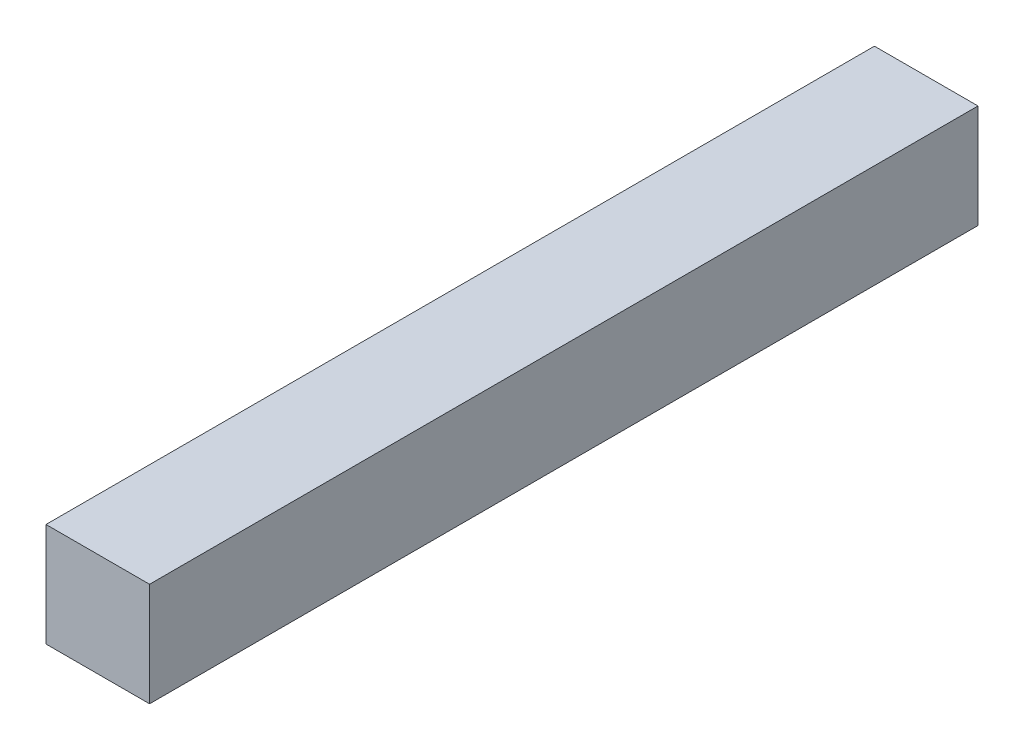
ISO-10303-21;
HEADER;
FILE_DESCRIPTION(('STEP AP214'),'2;1');
FILE_NAME('part.step','',(''),(''),'','','');
FILE_SCHEMA(('AUTOMOTIVE_DESIGN { 1 0 10303 214 1 1 1 1 }'));
ENDSEC;
DATA;
#1=APPLICATION_CONTEXT('core data for automotive mechanical design processes');
#2=APPLICATION_PROTOCOL_DEFINITION('international standard','automotive_design',2000,#1);
#3=PRODUCT_CONTEXT('',#1,'mechanical');
#4=PRODUCT('Part','Part','',(#3));
#5=PRODUCT_RELATED_PRODUCT_CATEGORY('part','',(#4));
#6=PRODUCT_DEFINITION_FORMATION('','',#4);
#7=PRODUCT_DEFINITION_CONTEXT('part definition',#1,'design');
#8=PRODUCT_DEFINITION('design','',#6,#7);
#9=PRODUCT_DEFINITION_SHAPE('','',#8);
#10=(LENGTH_UNIT() NAMED_UNIT(*) SI_UNIT(.MILLI.,.METRE.));
#11=(NAMED_UNIT(*) PLANE_ANGLE_UNIT() SI_UNIT($,.RADIAN.));
#12=(NAMED_UNIT(*) SI_UNIT($,.STERADIAN.) SOLID_ANGLE_UNIT());
#13=UNCERTAINTY_MEASURE_WITH_UNIT(LENGTH_MEASURE(1.E-05),#10,'distance_accuracy_value','');
#14=(GEOMETRIC_REPRESENTATION_CONTEXT(3) GLOBAL_UNCERTAINTY_ASSIGNED_CONTEXT((#13)) GLOBAL_UNIT_ASSIGNED_CONTEXT((#10,
#11,#12)) REPRESENTATION_CONTEXT('',''));
#15=CARTESIAN_POINT('',(0.,0.,0.));
#16=DIRECTION('',(0.,0.,1.));
#17=DIRECTION('',(1.,0.,0.));
#18=AXIS2_PLACEMENT_3D('',#15,#16,#17);
#19=CARTESIAN_POINT('',(19.05,19.05,-304.8));
#20=DIRECTION('',(1.,0.,0.));
#21=DIRECTION('',(0.,1.,0.));
#22=AXIS2_PLACEMENT_3D('',#19,#20,#21);
#23=PLANE('',#22);
#24=DIRECTION('',(0.,1.,0.));
#25=VECTOR('',#24,1.);
#26=CARTESIAN_POINT('',(19.05,19.05,0.));
#27=LINE('',#26,#25);
#28=CARTESIAN_POINT('',(19.05,-19.05,0.));
#29=VERTEX_POINT('',#28);
#30=CARTESIAN_POINT('',(19.05,19.05,0.));
#31=VERTEX_POINT('',#30);
#32=EDGE_CURVE('E109',#29,#31,#27,.T.);
#33=ORIENTED_EDGE('',*,*,#32,.F.);
#34=DIRECTION('',(0.,0.,1.));
#35=VECTOR('',#34,1.);
#36=CARTESIAN_POINT('',(19.05,-19.05,-304.8));
#37=LINE('',#36,#35);
#38=CARTESIAN_POINT('',(19.05,-19.05,-304.8));
#39=VERTEX_POINT('',#38);
#40=EDGE_CURVE('E11',#39,#29,#37,.T.);
#41=ORIENTED_EDGE('',*,*,#40,.F.);
#42=DIRECTION('',(0.,1.,0.));
#43=VECTOR('',#42,1.);
#44=CARTESIAN_POINT('',(19.05,19.05,-304.8));
#45=LINE('',#44,#43);
#46=CARTESIAN_POINT('',(19.05,19.05,-304.8));
#47=VERTEX_POINT('',#46);
#48=EDGE_CURVE('E101',#39,#47,#45,.T.);
#49=ORIENTED_EDGE('',*,*,#48,.T.);
#50=DIRECTION('',(0.,0.,1.));
#51=VECTOR('',#50,1.);
#52=CARTESIAN_POINT('',(19.05,19.05,-304.8));
#53=LINE('',#52,#51);
#54=EDGE_CURVE('E42',#47,#31,#53,.T.);
#55=ORIENTED_EDGE('',*,*,#54,.T.);
#56=EDGE_LOOP('',(#33,#41,#49,#55));
#57=FACE_BOUND('',#56,.T.);
#58=ADVANCED_FACE('F39',(#57),#23,.T.);
#59=CARTESIAN_POINT('',(-19.05,-19.05,-304.8));
#60=DIRECTION('',(0.,-1.,0.));
#61=DIRECTION('',(0.,0.,-1.));
#62=AXIS2_PLACEMENT_3D('',#59,#60,#61);
#63=PLANE('',#62);
#64=DIRECTION('',(1.,0.,0.));
#65=VECTOR('',#64,1.);
#66=CARTESIAN_POINT('',(-19.05,-19.05,0.));
#67=LINE('',#66,#65);
#68=CARTESIAN_POINT('',(-19.05,-19.05,0.));
#69=VERTEX_POINT('',#68);
#70=EDGE_CURVE('E104',#69,#29,#67,.T.);
#71=ORIENTED_EDGE('',*,*,#70,.F.);
#72=DIRECTION('',(0.,0.,1.));
#73=VECTOR('',#72,1.);
#74=CARTESIAN_POINT('',(-19.05,-19.05,-304.8));
#75=LINE('',#74,#73);
#76=CARTESIAN_POINT('',(-19.05,-19.05,-304.8));
#77=VERTEX_POINT('',#76);
#78=EDGE_CURVE('E49',#77,#69,#75,.T.);
#79=ORIENTED_EDGE('',*,*,#78,.F.);
#80=DIRECTION('',(1.,0.,0.));
#81=VECTOR('',#80,1.);
#82=CARTESIAN_POINT('',(-19.05,-19.05,-304.8));
#83=LINE('',#82,#81);
#84=EDGE_CURVE('E96',#77,#39,#83,.T.);
#85=ORIENTED_EDGE('',*,*,#84,.T.);
#86=ORIENTED_EDGE('',*,*,#40,.T.);
#87=EDGE_LOOP('',(#71,#79,#85,#86));
#88=FACE_BOUND('',#87,.T.);
#89=ADVANCED_FACE('F125',(#88),#63,.T.);
#90=CARTESIAN_POINT('',(-19.05,19.05,-304.8));
#91=DIRECTION('',(-1.,0.,0.));
#92=DIRECTION('',(0.,-1.,0.));
#93=AXIS2_PLACEMENT_3D('',#90,#91,#92);
#94=PLANE('',#93);
#95=DIRECTION('',(0.,-1.,0.));
#96=VECTOR('',#95,1.);
#97=CARTESIAN_POINT('',(-19.05,19.05,0.));
#98=LINE('',#97,#96);
#99=CARTESIAN_POINT('',(-19.05,19.05,0.));
#100=VERTEX_POINT('',#99);
#101=EDGE_CURVE('E90',#100,#69,#98,.T.);
#102=ORIENTED_EDGE('',*,*,#101,.F.);
#103=DIRECTION('',(0.,0.,1.));
#104=VECTOR('',#103,1.);
#105=CARTESIAN_POINT('',(-19.05,19.05,-304.8));
#106=LINE('',#105,#104);
#107=CARTESIAN_POINT('',(-19.05,19.05,-304.8));
#108=VERTEX_POINT('',#107);
#109=EDGE_CURVE('E85',#108,#100,#106,.T.);
#110=ORIENTED_EDGE('',*,*,#109,.F.);
#111=DIRECTION('',(0.,-1.,0.));
#112=VECTOR('',#111,1.);
#113=CARTESIAN_POINT('',(-19.05,19.05,-304.8));
#114=LINE('',#113,#112);
#115=EDGE_CURVE('E88',#108,#77,#114,.T.);
#116=ORIENTED_EDGE('',*,*,#115,.T.);
#117=ORIENTED_EDGE('',*,*,#78,.T.);
#118=EDGE_LOOP('',(#102,#110,#116,#117));
#119=FACE_BOUND('',#118,.T.);
#120=ADVANCED_FACE('F87',(#119),#94,.T.);
#121=CARTESIAN_POINT('',(-19.05,19.05,-304.8));
#122=DIRECTION('',(0.,1.,0.));
#123=DIRECTION('',(0.,0.,1.));
#124=AXIS2_PLACEMENT_3D('',#121,#122,#123);
#125=PLANE('',#124);
#126=DIRECTION('',(-1.,0.,0.));
#127=VECTOR('',#126,1.);
#128=CARTESIAN_POINT('',(-19.05,19.05,0.));
#129=LINE('',#128,#127);
#130=EDGE_CURVE('E113',#31,#100,#129,.T.);
#131=ORIENTED_EDGE('',*,*,#130,.F.);
#132=ORIENTED_EDGE('',*,*,#54,.F.);
#133=DIRECTION('',(-1.,0.,0.));
#134=VECTOR('',#133,1.);
#135=CARTESIAN_POINT('',(-19.05,19.05,-304.8));
#136=LINE('',#135,#134);
#137=EDGE_CURVE('E95',#47,#108,#136,.T.);
#138=ORIENTED_EDGE('',*,*,#137,.T.);
#139=ORIENTED_EDGE('',*,*,#109,.T.);
#140=EDGE_LOOP('',(#131,#132,#138,#139));
#141=FACE_BOUND('',#140,.T.);
#142=ADVANCED_FACE('F99',(#141),#125,.T.);
#143=CARTESIAN_POINT('',(0.,0.,-304.8));
#144=DIRECTION('',(0.,0.,1.));
#145=DIRECTION('',(1.,0.,0.));
#146=AXIS2_PLACEMENT_3D('',#143,#144,#145);
#147=PLANE('',#146);
#148=ORIENTED_EDGE('',*,*,#48,.F.);
#149=ORIENTED_EDGE('',*,*,#84,.F.);
#150=ORIENTED_EDGE('',*,*,#115,.F.);
#151=ORIENTED_EDGE('',*,*,#137,.F.);
#152=EDGE_LOOP('',(#148,#149,#150,#151));
#153=FACE_BOUND('',#152,.T.);
#154=ADVANCED_FACE('F94',(#153),#147,.F.);
#155=CARTESIAN_POINT('',(0.,0.,0.));
#156=DIRECTION('',(0.,0.,1.));
#157=DIRECTION('',(1.,0.,0.));
#158=AXIS2_PLACEMENT_3D('',#155,#156,#157);
#159=PLANE('',#158);
#160=ORIENTED_EDGE('',*,*,#32,.T.);
#161=ORIENTED_EDGE('',*,*,#130,.T.);
#162=ORIENTED_EDGE('',*,*,#101,.T.);
#163=ORIENTED_EDGE('',*,*,#70,.T.);
#164=EDGE_LOOP('',(#160,#161,#162,#163));
#165=FACE_BOUND('',#164,.T.);
#166=ADVANCED_FACE('F124',(#165),#159,.T.);
#167=CLOSED_SHELL('',(#58,#89,#120,#142,#154,#166));
#168=MANIFOLD_SOLID_BREP('B2',#167);
#169=ADVANCED_BREP_SHAPE_REPRESENTATION('',(#18,#168),#14);
#170=SHAPE_DEFINITION_REPRESENTATION(#9,#169);
ENDSEC;
END-ISO-10303-21;
